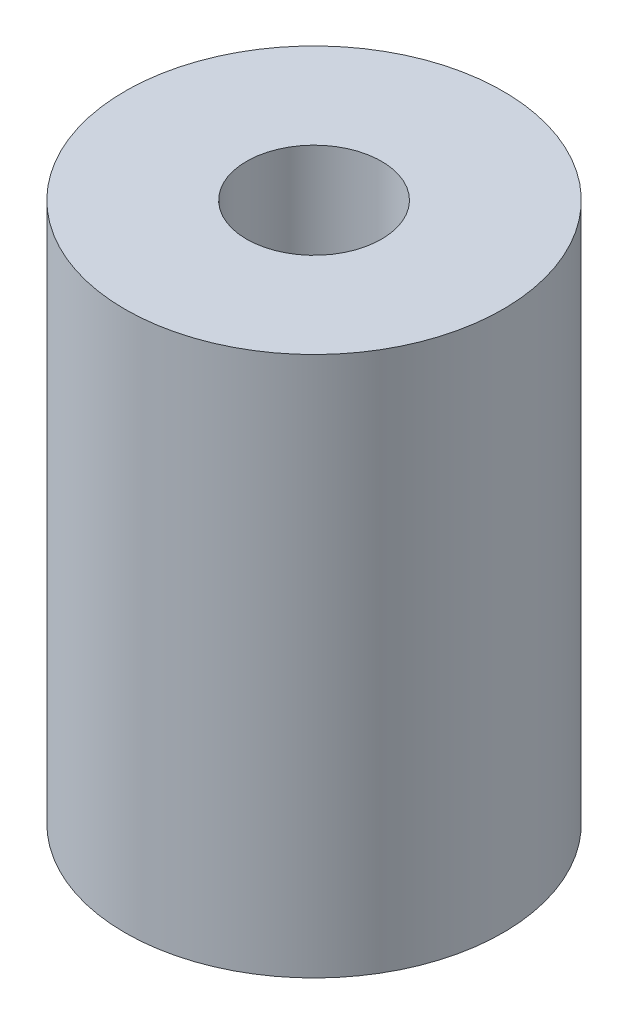
ISO-10303-21;
HEADER;
FILE_DESCRIPTION(('STEP AP214'),'2;1');
FILE_NAME('part.step','',(''),(''),'','','');
FILE_SCHEMA(('AUTOMOTIVE_DESIGN { 1 0 10303 214 1 1 1 1 }'));
ENDSEC;
DATA;
#1=APPLICATION_CONTEXT('core data for automotive mechanical design processes');
#2=APPLICATION_PROTOCOL_DEFINITION('international standard','automotive_design',2000,#1);
#3=PRODUCT_CONTEXT('',#1,'mechanical');
#4=PRODUCT('Part','Part','',(#3));
#5=PRODUCT_RELATED_PRODUCT_CATEGORY('part','',(#4));
#6=PRODUCT_DEFINITION_FORMATION('','',#4);
#7=PRODUCT_DEFINITION_CONTEXT('part definition',#1,'design');
#8=PRODUCT_DEFINITION('design','',#6,#7);
#9=PRODUCT_DEFINITION_SHAPE('','',#8);
#10=(LENGTH_UNIT() NAMED_UNIT(*) SI_UNIT(.MILLI.,.METRE.));
#11=(NAMED_UNIT(*) PLANE_ANGLE_UNIT() SI_UNIT($,.RADIAN.));
#12=(NAMED_UNIT(*) SI_UNIT($,.STERADIAN.) SOLID_ANGLE_UNIT());
#13=UNCERTAINTY_MEASURE_WITH_UNIT(LENGTH_MEASURE(1.E-05),#10,'distance_accuracy_value','');
#14=(GEOMETRIC_REPRESENTATION_CONTEXT(3) GLOBAL_UNCERTAINTY_ASSIGNED_CONTEXT((#13)) GLOBAL_UNIT_ASSIGNED_CONTEXT((#10,
#11,#12)) REPRESENTATION_CONTEXT('',''));
#15=CARTESIAN_POINT('',(0.,0.,0.));
#16=DIRECTION('',(0.,0.,1.));
#17=DIRECTION('',(1.,0.,0.));
#18=AXIS2_PLACEMENT_3D('',#15,#16,#17);
#19=CARTESIAN_POINT('',(0.,5.,0.));
#20=DIRECTION('',(0.,1.,0.));
#21=DIRECTION('',(0.,0.,1.));
#22=AXIS2_PLACEMENT_3D('',#19,#20,#21);
#23=PLANE('',#22);
#24=CARTESIAN_POINT('',(0.,5.,0.));
#25=DIRECTION('',(0.,1.,0.));
#26=DIRECTION('',(0.,0.,1.));
#27=AXIS2_PLACEMENT_3D('',#24,#25,#26);
#28=CIRCLE('',#27,1.24999999999999);
#29=CARTESIAN_POINT('',(0.,5.,1.24999999999999));
#30=VERTEX_POINT('',#29);
#31=EDGE_CURVE('E54',#30,#30,#28,.T.);
#32=ORIENTED_EDGE('',*,*,#31,.F.);
#33=EDGE_LOOP('',(#32));
#34=FACE_BOUND('',#33,.T.);
#35=CARTESIAN_POINT('',(0.,5.,0.));
#36=DIRECTION('',(0.,1.,0.));
#37=DIRECTION('',(0.,0.,1.));
#38=AXIS2_PLACEMENT_3D('',#35,#36,#37);
#39=CIRCLE('',#38,3.5);
#40=CARTESIAN_POINT('',(0.,5.,3.5));
#41=VERTEX_POINT('',#40);
#42=EDGE_CURVE('E10',#41,#41,#39,.T.);
#43=ORIENTED_EDGE('',*,*,#42,.T.);
#44=EDGE_LOOP('',(#43));
#45=FACE_BOUND('',#44,.T.);
#46=ADVANCED_FACE('F39',(#34,#45),#23,.T.);
#47=CARTESIAN_POINT('',(0.,-5.,0.));
#48=DIRECTION('',(0.,1.,0.));
#49=DIRECTION('',(0.,0.,1.));
#50=AXIS2_PLACEMENT_3D('',#47,#48,#49);
#51=PLANE('',#50);
#52=CARTESIAN_POINT('',(0.,-5.,0.));
#53=DIRECTION('',(0.,1.,0.));
#54=DIRECTION('',(0.,0.,1.));
#55=AXIS2_PLACEMENT_3D('',#52,#53,#54);
#56=CIRCLE('',#55,1.25);
#57=CARTESIAN_POINT('',(0.,-5.,1.25));
#58=VERTEX_POINT('',#57);
#59=EDGE_CURVE('E50',#58,#58,#56,.T.);
#60=ORIENTED_EDGE('',*,*,#59,.T.);
#61=EDGE_LOOP('',(#60));
#62=FACE_BOUND('',#61,.T.);
#63=CARTESIAN_POINT('',(0.,-5.,0.));
#64=DIRECTION('',(0.,1.,0.));
#65=DIRECTION('',(0.,0.,1.));
#66=AXIS2_PLACEMENT_3D('',#63,#64,#65);
#67=CIRCLE('',#66,3.5);
#68=CARTESIAN_POINT('',(0.,-5.,3.5));
#69=VERTEX_POINT('',#68);
#70=EDGE_CURVE('E43',#69,#69,#67,.T.);
#71=ORIENTED_EDGE('',*,*,#70,.F.);
#72=EDGE_LOOP('',(#71));
#73=FACE_BOUND('',#72,.T.);
#74=ADVANCED_FACE('F61',(#62,#73),#51,.F.);
#75=CARTESIAN_POINT('',(0.,5.,0.));
#76=DIRECTION('',(0.,-1.,0.));
#77=DIRECTION('',(0.,0.,-1.));
#78=AXIS2_PLACEMENT_3D('',#75,#76,#77);
#79=CYLINDRICAL_SURFACE('',#78,3.5);
#80=ORIENTED_EDGE('',*,*,#42,.F.);
#81=EDGE_LOOP('',(#80));
#82=FACE_BOUND('',#81,.T.);
#83=ORIENTED_EDGE('',*,*,#70,.T.);
#84=EDGE_LOOP('',(#83));
#85=FACE_BOUND('',#84,.T.);
#86=ADVANCED_FACE('F41',(#82,#85),#79,.T.);
#87=CARTESIAN_POINT('',(0.,5.,0.));
#88=DIRECTION('',(0.,1.,0.));
#89=DIRECTION('',(0.,0.,1.));
#90=AXIS2_PLACEMENT_3D('',#87,#88,#89);
#91=CYLINDRICAL_SURFACE('',#90,1.24999999999999);
#92=ORIENTED_EDGE('',*,*,#59,.F.);
#93=EDGE_LOOP('',(#92));
#94=FACE_BOUND('',#93,.T.);
#95=ORIENTED_EDGE('',*,*,#31,.T.);
#96=EDGE_LOOP('',(#95));
#97=FACE_BOUND('',#96,.T.);
#98=ADVANCED_FACE('F58',(#94,#97),#91,.F.);
#99=CLOSED_SHELL('',(#46,#74,#86,#98));
#100=MANIFOLD_SOLID_BREP('B2',#99);
#101=ADVANCED_BREP_SHAPE_REPRESENTATION('',(#18,#100),#14);
#102=SHAPE_DEFINITION_REPRESENTATION(#9,#101);
ENDSEC;
END-ISO-10303-21;
